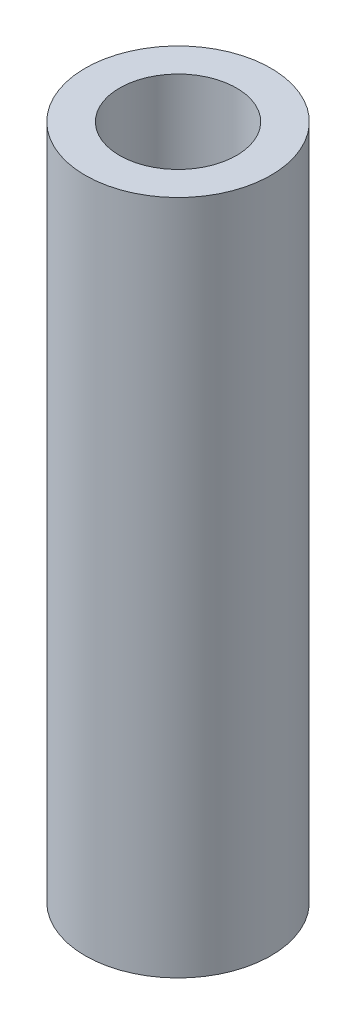
ISO-10303-21;
HEADER;
FILE_DESCRIPTION(('STEP AP214'),'2;1');
FILE_NAME('part.step','',(''),(''),'','','');
FILE_SCHEMA(('AUTOMOTIVE_DESIGN { 1 0 10303 214 1 1 1 1 }'));
ENDSEC;
DATA;
#1=APPLICATION_CONTEXT('core data for automotive mechanical design processes');
#2=APPLICATION_PROTOCOL_DEFINITION('international standard','automotive_design',2000,#1);
#3=PRODUCT_CONTEXT('',#1,'mechanical');
#4=PRODUCT('Part','Part','',(#3));
#5=PRODUCT_RELATED_PRODUCT_CATEGORY('part','',(#4));
#6=PRODUCT_DEFINITION_FORMATION('','',#4);
#7=PRODUCT_DEFINITION_CONTEXT('part definition',#1,'design');
#8=PRODUCT_DEFINITION('design','',#6,#7);
#9=PRODUCT_DEFINITION_SHAPE('','',#8);
#10=(LENGTH_UNIT() NAMED_UNIT(*) SI_UNIT(.MILLI.,.METRE.));
#11=(NAMED_UNIT(*) PLANE_ANGLE_UNIT() SI_UNIT($,.RADIAN.));
#12=(NAMED_UNIT(*) SI_UNIT($,.STERADIAN.) SOLID_ANGLE_UNIT());
#13=UNCERTAINTY_MEASURE_WITH_UNIT(LENGTH_MEASURE(1.E-05),#10,'distance_accuracy_value','');
#14=(GEOMETRIC_REPRESENTATION_CONTEXT(3) GLOBAL_UNCERTAINTY_ASSIGNED_CONTEXT((#13)) GLOBAL_UNIT_ASSIGNED_CONTEXT((#10,
#11,#12)) REPRESENTATION_CONTEXT('',''));
#15=CARTESIAN_POINT('',(0.,0.,0.));
#16=DIRECTION('',(0.,0.,1.));
#17=DIRECTION('',(1.,0.,0.));
#18=AXIS2_PLACEMENT_3D('',#15,#16,#17);
#19=CARTESIAN_POINT('',(0.,-23.114,0.));
#20=DIRECTION('',(0.,1.,0.));
#21=DIRECTION('',(0.,0.,1.));
#22=AXIS2_PLACEMENT_3D('',#19,#20,#21);
#23=CYLINDRICAL_SURFACE('',#22,3.175);
#24=CARTESIAN_POINT('',(0.,-23.114,0.));
#25=DIRECTION('',(0.,1.,0.));
#26=DIRECTION('',(0.,0.,1.));
#27=AXIS2_PLACEMENT_3D('',#24,#25,#26);
#28=CIRCLE('',#27,3.175);
#29=CARTESIAN_POINT('',(0.,-23.114,3.175));
#30=VERTEX_POINT('',#29);
#31=EDGE_CURVE('E10',#30,#30,#28,.T.);
#32=ORIENTED_EDGE('',*,*,#31,.T.);
#33=EDGE_LOOP('',(#32));
#34=FACE_BOUND('',#33,.T.);
#35=CARTESIAN_POINT('',(0.,0.,0.));
#36=DIRECTION('',(0.,1.,0.));
#37=DIRECTION('',(0.,0.,1.));
#38=AXIS2_PLACEMENT_3D('',#35,#36,#37);
#39=CIRCLE('',#38,3.175);
#40=CARTESIAN_POINT('',(0.,0.,3.175));
#41=VERTEX_POINT('',#40);
#42=EDGE_CURVE('E38',#41,#41,#39,.T.);
#43=ORIENTED_EDGE('',*,*,#42,.F.);
#44=EDGE_LOOP('',(#43));
#45=FACE_BOUND('',#44,.T.);
#46=ADVANCED_FACE('F35',(#34,#45),#23,.T.);
#47=CARTESIAN_POINT('',(0.,-23.114,0.));
#48=DIRECTION('',(0.,1.,0.));
#49=DIRECTION('',(0.,0.,1.));
#50=AXIS2_PLACEMENT_3D('',#47,#48,#49);
#51=PLANE('',#50);
#52=CARTESIAN_POINT('',(0.,-23.114,0.));
#53=DIRECTION('',(0.,1.,0.));
#54=DIRECTION('',(0.,0.,1.));
#55=AXIS2_PLACEMENT_3D('',#52,#53,#54);
#56=CIRCLE('',#55,2.);
#57=CARTESIAN_POINT('',(0.,-23.114,2.));
#58=VERTEX_POINT('',#57);
#59=EDGE_CURVE('E45',#58,#58,#56,.T.);
#60=ORIENTED_EDGE('',*,*,#59,.T.);
#61=EDGE_LOOP('',(#60));
#62=FACE_BOUND('',#61,.T.);
#63=ORIENTED_EDGE('',*,*,#31,.F.);
#64=EDGE_LOOP('',(#63));
#65=FACE_BOUND('',#64,.T.);
#66=ADVANCED_FACE('F53',(#62,#65),#51,.F.);
#67=CARTESIAN_POINT('',(0.,0.,0.));
#68=DIRECTION('',(0.,1.,0.));
#69=DIRECTION('',(0.,0.,1.));
#70=AXIS2_PLACEMENT_3D('',#67,#68,#69);
#71=PLANE('',#70);
#72=CARTESIAN_POINT('',(0.,0.,0.));
#73=DIRECTION('',(0.,1.,0.));
#74=DIRECTION('',(0.,0.,1.));
#75=AXIS2_PLACEMENT_3D('',#72,#73,#74);
#76=CIRCLE('',#75,2.);
#77=CARTESIAN_POINT('',(0.,0.,2.));
#78=VERTEX_POINT('',#77);
#79=EDGE_CURVE('E47',#78,#78,#76,.T.);
#80=ORIENTED_EDGE('',*,*,#79,.F.);
#81=EDGE_LOOP('',(#80));
#82=FACE_BOUND('',#81,.T.);
#83=ORIENTED_EDGE('',*,*,#42,.T.);
#84=EDGE_LOOP('',(#83));
#85=FACE_BOUND('',#84,.T.);
#86=ADVANCED_FACE('F59',(#82,#85),#71,.T.);
#87=CARTESIAN_POINT('',(0.,-23.114,0.));
#88=DIRECTION('',(0.,1.,0.));
#89=DIRECTION('',(0.,0.,1.));
#90=AXIS2_PLACEMENT_3D('',#87,#88,#89);
#91=CYLINDRICAL_SURFACE('',#90,2.);
#92=ORIENTED_EDGE('',*,*,#59,.F.);
#93=EDGE_LOOP('',(#92));
#94=FACE_BOUND('',#93,.T.);
#95=ORIENTED_EDGE('',*,*,#79,.T.);
#96=EDGE_LOOP('',(#95));
#97=FACE_BOUND('',#96,.T.);
#98=ADVANCED_FACE('F56',(#94,#97),#91,.F.);
#99=CLOSED_SHELL('',(#46,#66,#86,#98));
#100=MANIFOLD_SOLID_BREP('B2',#99);
#101=ADVANCED_BREP_SHAPE_REPRESENTATION('',(#18,#100),#14);
#102=SHAPE_DEFINITION_REPRESENTATION(#9,#101);
ENDSEC;
END-ISO-10303-21;
